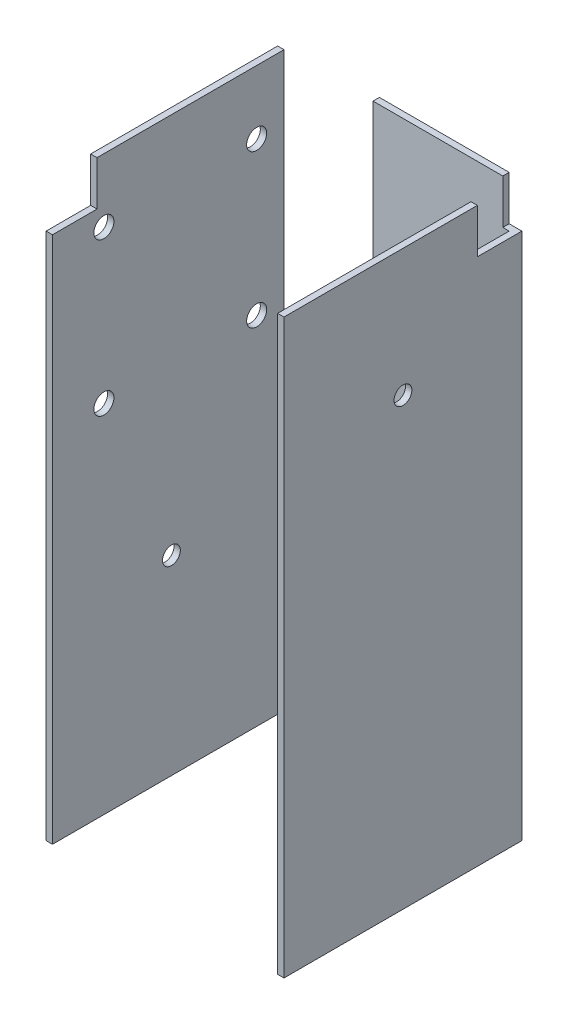
ISO-10303-21;
HEADER;
FILE_DESCRIPTION(('STEP AP214'),'2;1');
FILE_NAME('part.step','',(''),(''),'','','');
FILE_SCHEMA(('AUTOMOTIVE_DESIGN { 1 0 10303 214 1 1 1 1 }'));
ENDSEC;
DATA;
#1=APPLICATION_CONTEXT('core data for automotive mechanical design processes');
#2=APPLICATION_PROTOCOL_DEFINITION('international standard','automotive_design',2000,#1);
#3=PRODUCT_CONTEXT('',#1,'mechanical');
#4=PRODUCT('Part','Part','',(#3));
#5=PRODUCT_RELATED_PRODUCT_CATEGORY('part','',(#4));
#6=PRODUCT_DEFINITION_FORMATION('','',#4);
#7=PRODUCT_DEFINITION_CONTEXT('part definition',#1,'design');
#8=PRODUCT_DEFINITION('design','',#6,#7);
#9=PRODUCT_DEFINITION_SHAPE('','',#8);
#10=(LENGTH_UNIT() NAMED_UNIT(*) SI_UNIT(.MILLI.,.METRE.));
#11=(NAMED_UNIT(*) PLANE_ANGLE_UNIT() SI_UNIT($,.RADIAN.));
#12=(NAMED_UNIT(*) SI_UNIT($,.STERADIAN.) SOLID_ANGLE_UNIT());
#13=UNCERTAINTY_MEASURE_WITH_UNIT(LENGTH_MEASURE(1.E-05),#10,'distance_accuracy_value','');
#14=(GEOMETRIC_REPRESENTATION_CONTEXT(3) GLOBAL_UNCERTAINTY_ASSIGNED_CONTEXT((#13)) GLOBAL_UNIT_ASSIGNED_CONTEXT((#10,
#11,#12)) REPRESENTATION_CONTEXT('',''));
#15=CARTESIAN_POINT('',(0.,0.,0.));
#16=DIRECTION('',(0.,0.,1.));
#17=DIRECTION('',(1.,0.,0.));
#18=AXIS2_PLACEMENT_3D('',#15,#16,#17);
#19=CARTESIAN_POINT('',(0.,114.3,0.));
#20=DIRECTION('',(0.,1.,0.));
#21=DIRECTION('',(0.,0.,1.));
#22=AXIS2_PLACEMENT_3D('',#19,#20,#21);
#23=PLANE('',#22);
#24=DIRECTION('',(1.,0.,0.));
#25=VECTOR('',#24,1.);
#26=CARTESIAN_POINT('',(21.209,114.3,-14.859));
#27=LINE('',#26,#25);
#28=CARTESIAN_POINT('',(22.479,114.3,-14.859));
#29=VERTEX_POINT('',#28);
#30=CARTESIAN_POINT('',(23.749,114.3,-14.859));
#31=VERTEX_POINT('',#30);
#32=EDGE_CURVE('E313',#29,#31,#27,.T.);
#33=ORIENTED_EDGE('',*,*,#32,.F.);
#34=DIRECTION('',(0.,0.,-1.));
#35=VECTOR('',#34,1.);
#36=CARTESIAN_POINT('',(22.479,114.3,0.));
#37=LINE('',#36,#35);
#38=CARTESIAN_POINT('',(22.479,114.3,23.749));
#39=VERTEX_POINT('',#38);
#40=EDGE_CURVE('E240',#39,#29,#37,.T.);
#41=ORIENTED_EDGE('',*,*,#40,.F.);
#42=DIRECTION('',(1.,0.,0.));
#43=VECTOR('',#42,1.);
#44=CARTESIAN_POINT('',(0.,114.3,23.749));
#45=LINE('',#44,#43);
#46=CARTESIAN_POINT('',(23.749,114.3,23.749));
#47=VERTEX_POINT('',#46);
#48=EDGE_CURVE('E201',#39,#47,#45,.T.);
#49=ORIENTED_EDGE('',*,*,#48,.T.);
#50=DIRECTION('',(0.,0.,1.));
#51=VECTOR('',#50,1.);
#52=CARTESIAN_POINT('',(23.749,114.3,0.));
#53=LINE('',#52,#51);
#54=EDGE_CURVE('E194',#31,#47,#53,.T.);
#55=ORIENTED_EDGE('',*,*,#54,.F.);
#56=EDGE_LOOP('',(#33,#41,#49,#55));
#57=FACE_BOUND('',#56,.T.);
#58=ADVANCED_FACE('F44',(#57),#23,.T.);
#59=DIRECTION('',(0.,0.,1.));
#60=VECTOR('',#59,1.);
#61=CARTESIAN_POINT('',(21.209,114.3,-23.749));
#62=LINE('',#61,#60);
#63=CARTESIAN_POINT('',(21.209,114.3,-23.749));
#64=VERTEX_POINT('',#63);
#65=CARTESIAN_POINT('',(21.209,114.3,-22.479));
#66=VERTEX_POINT('',#65);
#67=EDGE_CURVE('E60',#64,#66,#62,.T.);
#68=ORIENTED_EDGE('',*,*,#67,.F.);
#69=DIRECTION('',(1.,0.,0.));
#70=VECTOR('',#69,1.);
#71=CARTESIAN_POINT('',(0.,114.3,-23.749));
#72=LINE('',#71,#70);
#73=CARTESIAN_POINT('',(-4.699,114.3,-23.749));
#74=VERTEX_POINT('',#73);
#75=EDGE_CURVE('E182',#74,#64,#72,.T.);
#76=ORIENTED_EDGE('',*,*,#75,.F.);
#77=DIRECTION('',(0.,0.,-1.));
#78=VECTOR('',#77,1.);
#79=CARTESIAN_POINT('',(-4.699,114.3,-23.749));
#80=LINE('',#79,#78);
#81=CARTESIAN_POINT('',(-4.699,114.3,-22.479));
#82=VERTEX_POINT('',#81);
#83=EDGE_CURVE('E357',#82,#74,#80,.T.);
#84=ORIENTED_EDGE('',*,*,#83,.F.);
#85=DIRECTION('',(1.,0.,0.));
#86=VECTOR('',#85,1.);
#87=CARTESIAN_POINT('',(0.,114.3,-22.479));
#88=LINE('',#87,#86);
#89=EDGE_CURVE('E184',#82,#66,#88,.T.);
#90=ORIENTED_EDGE('',*,*,#89,.T.);
#91=EDGE_LOOP('',(#68,#76,#84,#90));
#92=FACE_BOUND('',#91,.T.);
#93=ADVANCED_FACE('F180',(#92),#23,.T.);
#94=CARTESIAN_POINT('',(22.479,114.3,0.));
#95=DIRECTION('',(-1.,0.,0.));
#96=DIRECTION('',(0.,0.,1.));
#97=AXIS2_PLACEMENT_3D('',#94,#95,#96);
#98=PLANE('',#97);
#99=DIRECTION('',(0.,0.,1.));
#100=VECTOR('',#99,1.);
#101=CARTESIAN_POINT('',(22.479,105.41,0.));
#102=LINE('',#101,#100);
#103=CARTESIAN_POINT('',(22.479,105.41,-22.479));
#104=VERTEX_POINT('',#103);
#105=CARTESIAN_POINT('',(22.479,105.41,-14.859));
#106=VERTEX_POINT('',#105);
#107=EDGE_CURVE('E327',#104,#106,#102,.T.);
#108=ORIENTED_EDGE('',*,*,#107,.F.);
#109=DIRECTION('',(0.,-1.,0.));
#110=VECTOR('',#109,1.);
#111=CARTESIAN_POINT('',(22.479,114.3,-22.479));
#112=LINE('',#111,#110);
#113=CARTESIAN_POINT('',(22.479,0.,-22.479));
#114=VERTEX_POINT('',#113);
#115=EDGE_CURVE('E209',#104,#114,#112,.T.);
#116=ORIENTED_EDGE('',*,*,#115,.T.);
#117=DIRECTION('',(0.,0.,-1.));
#118=VECTOR('',#117,1.);
#119=CARTESIAN_POINT('',(22.479,0.,0.));
#120=LINE('',#119,#118);
#121=CARTESIAN_POINT('',(22.479,0.,23.749));
#122=VERTEX_POINT('',#121);
#123=EDGE_CURVE('E210',#122,#114,#120,.T.);
#124=ORIENTED_EDGE('',*,*,#123,.F.);
#125=DIRECTION('',(0.,-1.,0.));
#126=VECTOR('',#125,1.);
#127=CARTESIAN_POINT('',(22.479,114.3,23.749));
#128=LINE('',#127,#126);
#129=EDGE_CURVE('E262',#39,#122,#128,.T.);
#130=ORIENTED_EDGE('',*,*,#129,.F.);
#131=ORIENTED_EDGE('',*,*,#40,.T.);
#132=DIRECTION('',(0.,1.,0.));
#133=VECTOR('',#132,1.);
#134=CARTESIAN_POINT('',(22.479,114.3,-14.859));
#135=LINE('',#134,#133);
#136=EDGE_CURVE('E332',#106,#29,#135,.T.);
#137=ORIENTED_EDGE('',*,*,#136,.F.);
#138=EDGE_LOOP('',(#108,#116,#124,#130,#131,#137));
#139=FACE_BOUND('',#138,.T.);
#140=CARTESIAN_POINT('',(22.479,88.9,0.));
#141=DIRECTION('',(-1.,0.,0.));
#142=DIRECTION('',(0.,0.,1.));
#143=AXIS2_PLACEMENT_3D('',#140,#141,#142);
#144=CIRCLE('',#143,1.778);
#145=CARTESIAN_POINT('',(22.479,88.9,1.778));
#146=VERTEX_POINT('',#145);
#147=EDGE_CURVE('E403',#146,#146,#144,.T.);
#148=ORIENTED_EDGE('',*,*,#147,.F.);
#149=EDGE_LOOP('',(#148));
#150=FACE_BOUND('',#149,.T.);
#151=ADVANCED_FACE('F46',(#139,#150),#98,.T.);
#152=CARTESIAN_POINT('',(0.,114.3,23.749));
#153=DIRECTION('',(0.,0.,-1.));
#154=DIRECTION('',(-1.,0.,0.));
#155=AXIS2_PLACEMENT_3D('',#152,#153,#154);
#156=PLANE('',#155);
#157=DIRECTION('',(1.,0.,0.));
#158=VECTOR('',#157,1.);
#159=CARTESIAN_POINT('',(0.,0.,23.749));
#160=LINE('',#159,#158);
#161=CARTESIAN_POINT('',(23.749,0.,23.749));
#162=VERTEX_POINT('',#161);
#163=EDGE_CURVE('E214',#122,#162,#160,.T.);
#164=ORIENTED_EDGE('',*,*,#163,.T.);
#165=DIRECTION('',(0.,-1.,0.));
#166=VECTOR('',#165,1.);
#167=CARTESIAN_POINT('',(23.749,114.3,23.749));
#168=LINE('',#167,#166);
#169=EDGE_CURVE('E259',#47,#162,#168,.T.);
#170=ORIENTED_EDGE('',*,*,#169,.F.);
#171=ORIENTED_EDGE('',*,*,#48,.F.);
#172=ORIENTED_EDGE('',*,*,#129,.T.);
#173=EDGE_LOOP('',(#164,#170,#171,#172));
#174=FACE_BOUND('',#173,.T.);
#175=ADVANCED_FACE('F424',(#174),#156,.F.);
#176=CARTESIAN_POINT('',(23.749,114.3,0.));
#177=DIRECTION('',(1.,0.,0.));
#178=DIRECTION('',(0.,0.,-1.));
#179=AXIS2_PLACEMENT_3D('',#176,#177,#178);
#180=PLANE('',#179);
#181=DIRECTION('',(0.,0.,-1.));
#182=VECTOR('',#181,1.);
#183=CARTESIAN_POINT('',(23.749,105.41,-23.749));
#184=LINE('',#183,#182);
#185=CARTESIAN_POINT('',(23.749,105.41,-14.859));
#186=VERTEX_POINT('',#185);
#187=CARTESIAN_POINT('',(23.749,105.41,-23.749));
#188=VERTEX_POINT('',#187);
#189=EDGE_CURVE('E175',#186,#188,#184,.T.);
#190=ORIENTED_EDGE('',*,*,#189,.F.);
#191=DIRECTION('',(0.,-1.,0.));
#192=VECTOR('',#191,1.);
#193=CARTESIAN_POINT('',(23.749,114.3,-14.859));
#194=LINE('',#193,#192);
#195=EDGE_CURVE('E319',#31,#186,#194,.T.);
#196=ORIENTED_EDGE('',*,*,#195,.F.);
#197=ORIENTED_EDGE('',*,*,#54,.T.);
#198=ORIENTED_EDGE('',*,*,#169,.T.);
#199=DIRECTION('',(0.,0.,1.));
#200=VECTOR('',#199,1.);
#201=CARTESIAN_POINT('',(23.749,0.,0.));
#202=LINE('',#201,#200);
#203=CARTESIAN_POINT('',(23.749,0.,-23.749));
#204=VERTEX_POINT('',#203);
#205=EDGE_CURVE('E219',#204,#162,#202,.T.);
#206=ORIENTED_EDGE('',*,*,#205,.F.);
#207=DIRECTION('',(0.,-1.,0.));
#208=VECTOR('',#207,1.);
#209=CARTESIAN_POINT('',(23.749,114.3,-23.749));
#210=LINE('',#209,#208);
#211=EDGE_CURVE('E256',#188,#204,#210,.T.);
#212=ORIENTED_EDGE('',*,*,#211,.F.);
#213=EDGE_LOOP('',(#190,#196,#197,#198,#206,#212));
#214=FACE_BOUND('',#213,.T.);
#215=CARTESIAN_POINT('',(23.749,88.9,0.));
#216=DIRECTION('',(1.,0.,0.));
#217=DIRECTION('',(0.,0.,-1.));
#218=AXIS2_PLACEMENT_3D('',#215,#216,#217);
#219=CIRCLE('',#218,1.778);
#220=CARTESIAN_POINT('',(23.749,88.9,-1.77799999999999));
#221=VERTEX_POINT('',#220);
#222=EDGE_CURVE('E279',#221,#221,#219,.T.);
#223=ORIENTED_EDGE('',*,*,#222,.F.);
#224=EDGE_LOOP('',(#223));
#225=FACE_BOUND('',#224,.T.);
#226=ADVANCED_FACE('F429',(#214,#225),#180,.T.);
#227=CARTESIAN_POINT('',(0.,114.3,-23.749));
#228=DIRECTION('',(0.,0.,-1.));
#229=DIRECTION('',(-1.,0.,0.));
#230=AXIS2_PLACEMENT_3D('',#227,#228,#229);
#231=PLANE('',#230);
#232=DIRECTION('',(1.,0.,0.));
#233=VECTOR('',#232,1.);
#234=CARTESIAN_POINT('',(21.209,105.41,-23.749));
#235=LINE('',#234,#233);
#236=CARTESIAN_POINT('',(21.209,105.41,-23.749));
#237=VERTEX_POINT('',#236);
#238=EDGE_CURVE('E311',#237,#188,#235,.T.);
#239=ORIENTED_EDGE('',*,*,#238,.T.);
#240=ORIENTED_EDGE('',*,*,#211,.T.);
#241=DIRECTION('',(1.,0.,0.));
#242=VECTOR('',#241,1.);
#243=CARTESIAN_POINT('',(0.,0.,-23.749));
#244=LINE('',#243,#242);
#245=CARTESIAN_POINT('',(-23.749,0.,-23.749));
#246=VERTEX_POINT('',#245);
#247=EDGE_CURVE('E224',#246,#204,#244,.T.);
#248=ORIENTED_EDGE('',*,*,#247,.F.);
#249=DIRECTION('',(0.,-1.,0.));
#250=VECTOR('',#249,1.);
#251=CARTESIAN_POINT('',(-23.749,114.3,-23.749));
#252=LINE('',#251,#250);
#253=CARTESIAN_POINT('',(-23.749,66.675,-23.749));
#254=VERTEX_POINT('',#253);
#255=EDGE_CURVE('E253',#254,#246,#252,.T.);
#256=ORIENTED_EDGE('',*,*,#255,.F.);
#257=DIRECTION('',(-1.,0.,0.));
#258=VECTOR('',#257,1.);
#259=CARTESIAN_POINT('',(-23.749,66.675,-23.749));
#260=LINE('',#259,#258);
#261=CARTESIAN_POINT('',(-4.699,66.675,-23.749));
#262=VERTEX_POINT('',#261);
#263=EDGE_CURVE('E366',#262,#254,#260,.T.);
#264=ORIENTED_EDGE('',*,*,#263,.F.);
#265=DIRECTION('',(0.,1.,0.));
#266=VECTOR('',#265,1.);
#267=CARTESIAN_POINT('',(-4.699,66.675,-23.749));
#268=LINE('',#267,#266);
#269=EDGE_CURVE('E191',#262,#74,#268,.T.);
#270=ORIENTED_EDGE('',*,*,#269,.T.);
#271=ORIENTED_EDGE('',*,*,#75,.T.);
#272=DIRECTION('',(0.,1.,0.));
#273=VECTOR('',#272,1.);
#274=CARTESIAN_POINT('',(21.209,114.3,-23.749));
#275=LINE('',#274,#273);
#276=EDGE_CURVE('E166',#237,#64,#275,.T.);
#277=ORIENTED_EDGE('',*,*,#276,.F.);
#278=EDGE_LOOP('',(#239,#240,#248,#256,#264,#270,#271,#277));
#279=FACE_BOUND('',#278,.T.);
#280=CARTESIAN_POINT('',(0.,25.4,-23.749));
#281=DIRECTION('',(0.,0.,-1.));
#282=DIRECTION('',(-1.,0.,0.));
#283=AXIS2_PLACEMENT_3D('',#280,#281,#282);
#284=CIRCLE('',#283,1.778);
#285=CARTESIAN_POINT('',(-1.778,25.4,-23.749));
#286=VERTEX_POINT('',#285);
#287=EDGE_CURVE('E280',#286,#286,#284,.T.);
#288=ORIENTED_EDGE('',*,*,#287,.F.);
#289=EDGE_LOOP('',(#288));
#290=FACE_BOUND('',#289,.T.);
#291=CARTESIAN_POINT('',(0.,57.15,-23.749));
#292=DIRECTION('',(0.,0.,-1.));
#293=DIRECTION('',(-1.,0.,0.));
#294=AXIS2_PLACEMENT_3D('',#291,#292,#293);
#295=CIRCLE('',#294,1.778);
#296=CARTESIAN_POINT('',(-1.778,57.15,-23.749));
#297=VERTEX_POINT('',#296);
#298=EDGE_CURVE('E269',#297,#297,#295,.T.);
#299=ORIENTED_EDGE('',*,*,#298,.F.);
#300=EDGE_LOOP('',(#299));
#301=FACE_BOUND('',#300,.T.);
#302=ADVANCED_FACE('F188',(#279,#290,#301),#231,.T.);
#303=CARTESIAN_POINT('',(-23.749,114.3,0.));
#304=DIRECTION('',(1.,0.,0.));
#305=DIRECTION('',(0.,0.,-1.));
#306=AXIS2_PLACEMENT_3D('',#303,#304,#305);
#307=PLANE('',#306);
#308=CARTESIAN_POINT('',(-23.749,71.1,-17.018));
#309=DIRECTION('',(-1.,0.,0.));
#310=DIRECTION('',(0.,0.,1.));
#311=AXIS2_PLACEMENT_3D('',#308,#309,#310);
#312=CIRCLE('',#311,2.);
#313=CARTESIAN_POINT('',(-23.749,71.1,-15.018));
#314=VERTEX_POINT('',#313);
#315=EDGE_CURVE('E377',#314,#314,#312,.T.);
#316=ORIENTED_EDGE('',*,*,#315,.F.);
#317=EDGE_LOOP('',(#316));
#318=FACE_BOUND('',#317,.T.);
#319=CARTESIAN_POINT('',(-23.749,71.1,13.482));
#320=DIRECTION('',(-1.,0.,0.));
#321=DIRECTION('',(0.,0.,1.));
#322=AXIS2_PLACEMENT_3D('',#319,#320,#321);
#323=CIRCLE('',#322,2.00000000000001);
#324=CARTESIAN_POINT('',(-23.749,71.1,15.482));
#325=VERTEX_POINT('',#324);
#326=EDGE_CURVE('E387',#325,#325,#323,.T.);
#327=ORIENTED_EDGE('',*,*,#326,.F.);
#328=EDGE_LOOP('',(#327));
#329=FACE_BOUND('',#328,.T.);
#330=CARTESIAN_POINT('',(-23.749,101.6,13.482));
#331=DIRECTION('',(-1.,0.,0.));
#332=DIRECTION('',(0.,0.,1.));
#333=AXIS2_PLACEMENT_3D('',#330,#331,#332);
#334=CIRCLE('',#333,2.00000000000001);
#335=CARTESIAN_POINT('',(-23.749,101.6,15.482));
#336=VERTEX_POINT('',#335);
#337=EDGE_CURVE('E383',#336,#336,#334,.T.);
#338=ORIENTED_EDGE('',*,*,#337,.F.);
#339=EDGE_LOOP('',(#338));
#340=FACE_BOUND('',#339,.T.);
#341=CARTESIAN_POINT('',(-23.749,101.6,-17.018));
#342=DIRECTION('',(-1.,0.,0.));
#343=DIRECTION('',(0.,0.,1.));
#344=AXIS2_PLACEMENT_3D('',#341,#342,#343);
#345=CIRCLE('',#344,2.00000000000001);
#346=CARTESIAN_POINT('',(-23.749,101.6,-15.018));
#347=VERTEX_POINT('',#346);
#348=EDGE_CURVE('E286',#347,#347,#345,.T.);
#349=ORIENTED_EDGE('',*,*,#348,.F.);
#350=EDGE_LOOP('',(#349));
#351=FACE_BOUND('',#350,.T.);
#352=CARTESIAN_POINT('',(-23.749,38.1,0.));
#353=DIRECTION('',(-1.,0.,0.));
#354=DIRECTION('',(0.,0.,1.));
#355=AXIS2_PLACEMENT_3D('',#352,#353,#354);
#356=CIRCLE('',#355,1.778);
#357=CARTESIAN_POINT('',(-23.749,38.1,1.778));
#358=VERTEX_POINT('',#357);
#359=EDGE_CURVE('E274',#358,#358,#356,.T.);
#360=ORIENTED_EDGE('',*,*,#359,.F.);
#361=EDGE_LOOP('',(#360));
#362=FACE_BOUND('',#361,.T.);
#363=DIRECTION('',(0.,-1.,0.));
#364=VECTOR('',#363,1.);
#365=CARTESIAN_POINT('',(-23.749,114.3,23.749));
#366=LINE('',#365,#364);
#367=CARTESIAN_POINT('',(-23.749,105.41,23.749));
#368=VERTEX_POINT('',#367);
#369=CARTESIAN_POINT('',(-23.749,0.,23.749));
#370=VERTEX_POINT('',#369);
#371=EDGE_CURVE('E250',#368,#370,#366,.T.);
#372=ORIENTED_EDGE('',*,*,#371,.F.);
#373=DIRECTION('',(0.,0.,1.));
#374=VECTOR('',#373,1.);
#375=CARTESIAN_POINT('',(-23.749,105.41,23.749));
#376=LINE('',#375,#374);
#377=CARTESIAN_POINT('',(-23.749,105.41,14.859));
#378=VERTEX_POINT('',#377);
#379=EDGE_CURVE('E339',#378,#368,#376,.T.);
#380=ORIENTED_EDGE('',*,*,#379,.F.);
#381=DIRECTION('',(0.,-1.,0.));
#382=VECTOR('',#381,1.);
#383=CARTESIAN_POINT('',(-23.749,114.3,14.859));
#384=LINE('',#383,#382);
#385=CARTESIAN_POINT('',(-23.749,114.3,14.859));
#386=VERTEX_POINT('',#385);
#387=EDGE_CURVE('E335',#386,#378,#384,.T.);
#388=ORIENTED_EDGE('',*,*,#387,.F.);
#389=DIRECTION('',(0.,0.,1.));
#390=VECTOR('',#389,1.);
#391=CARTESIAN_POINT('',(-23.749,114.3,0.));
#392=LINE('',#391,#390);
#393=CARTESIAN_POINT('',(-23.749,114.3,-22.479));
#394=VERTEX_POINT('',#393);
#395=EDGE_CURVE('E193',#394,#386,#392,.T.);
#396=ORIENTED_EDGE('',*,*,#395,.F.);
#397=DIRECTION('',(0.,1.,0.));
#398=VECTOR('',#397,1.);
#399=CARTESIAN_POINT('',(-23.749,66.675,-22.479));
#400=LINE('',#399,#398);
#401=CARTESIAN_POINT('',(-23.749,66.675,-22.479));
#402=VERTEX_POINT('',#401);
#403=EDGE_CURVE('E369',#402,#394,#400,.T.);
#404=ORIENTED_EDGE('',*,*,#403,.F.);
#405=DIRECTION('',(0.,0.,1.));
#406=VECTOR('',#405,1.);
#407=CARTESIAN_POINT('',(-23.749,66.675,-23.749));
#408=LINE('',#407,#406);
#409=EDGE_CURVE('E352',#254,#402,#408,.T.);
#410=ORIENTED_EDGE('',*,*,#409,.F.);
#411=ORIENTED_EDGE('',*,*,#255,.T.);
#412=DIRECTION('',(0.,0.,1.));
#413=VECTOR('',#412,1.);
#414=CARTESIAN_POINT('',(-23.749,0.,0.));
#415=LINE('',#414,#413);
#416=EDGE_CURVE('E228',#246,#370,#415,.T.);
#417=ORIENTED_EDGE('',*,*,#416,.T.);
#418=EDGE_LOOP('',(#372,#380,#388,#396,#404,#410,#411,#417));
#419=FACE_BOUND('',#418,.T.);
#420=ADVANCED_FACE('F450',(#318,#329,#340,#351,#362,#419),#307,.F.);
#421=DIRECTION('',(0.,-1.,0.));
#422=VECTOR('',#421,1.);
#423=CARTESIAN_POINT('',(-22.479,114.3,23.749));
#424=LINE('',#423,#422);
#425=CARTESIAN_POINT('',(-22.479,105.41,23.749));
#426=VERTEX_POINT('',#425);
#427=CARTESIAN_POINT('',(-22.479,0.,23.749));
#428=VERTEX_POINT('',#427);
#429=EDGE_CURVE('E247',#426,#428,#424,.T.);
#430=ORIENTED_EDGE('',*,*,#429,.F.);
#431=DIRECTION('',(-1.,0.,0.));
#432=VECTOR('',#431,1.);
#433=CARTESIAN_POINT('',(14.351,105.41,23.749));
#434=LINE('',#433,#432);
#435=EDGE_CURVE('E343',#426,#368,#434,.T.);
#436=ORIENTED_EDGE('',*,*,#435,.T.);
#437=ORIENTED_EDGE('',*,*,#371,.T.);
#438=EDGE_CURVE('E220',#370,#428,#160,.T.);
#439=ORIENTED_EDGE('',*,*,#438,.T.);
#440=EDGE_LOOP('',(#430,#436,#437,#439));
#441=FACE_BOUND('',#440,.T.);
#442=ADVANCED_FACE('F471',(#441),#156,.F.);
#443=CARTESIAN_POINT('',(-22.479,114.3,0.));
#444=DIRECTION('',(-1.,0.,0.));
#445=DIRECTION('',(0.,0.,1.));
#446=AXIS2_PLACEMENT_3D('',#443,#444,#445);
#447=PLANE('',#446);
#448=CARTESIAN_POINT('',(-22.479,71.1,-17.018));
#449=DIRECTION('',(-1.,0.,0.));
#450=DIRECTION('',(0.,0.,1.));
#451=AXIS2_PLACEMENT_3D('',#448,#449,#450);
#452=CIRCLE('',#451,2.);
#453=CARTESIAN_POINT('',(-22.479,71.1,-15.018));
#454=VERTEX_POINT('',#453);
#455=EDGE_CURVE('E294',#454,#454,#452,.T.);
#456=ORIENTED_EDGE('',*,*,#455,.T.);
#457=EDGE_LOOP('',(#456));
#458=FACE_BOUND('',#457,.T.);
#459=CARTESIAN_POINT('',(-22.479,71.1,13.482));
#460=DIRECTION('',(-1.,0.,0.));
#461=DIRECTION('',(0.,0.,1.));
#462=AXIS2_PLACEMENT_3D('',#459,#460,#461);
#463=CIRCLE('',#462,2.00000000000001);
#464=CARTESIAN_POINT('',(-22.479,71.1,15.482));
#465=VERTEX_POINT('',#464);
#466=EDGE_CURVE('E290',#465,#465,#463,.T.);
#467=ORIENTED_EDGE('',*,*,#466,.T.);
#468=EDGE_LOOP('',(#467));
#469=FACE_BOUND('',#468,.T.);
#470=CARTESIAN_POINT('',(-22.479,101.6,13.482));
#471=DIRECTION('',(-1.,0.,0.));
#472=DIRECTION('',(0.,0.,1.));
#473=AXIS2_PLACEMENT_3D('',#470,#471,#472);
#474=CIRCLE('',#473,2.00000000000001);
#475=CARTESIAN_POINT('',(-22.479,101.6,15.482));
#476=VERTEX_POINT('',#475);
#477=EDGE_CURVE('E285',#476,#476,#474,.T.);
#478=ORIENTED_EDGE('',*,*,#477,.T.);
#479=EDGE_LOOP('',(#478));
#480=FACE_BOUND('',#479,.T.);
#481=CARTESIAN_POINT('',(-22.479,101.6,-17.018));
#482=DIRECTION('',(-1.,0.,0.));
#483=DIRECTION('',(0.,0.,1.));
#484=AXIS2_PLACEMENT_3D('',#481,#482,#483);
#485=CIRCLE('',#484,2.00000000000001);
#486=CARTESIAN_POINT('',(-22.479,101.6,-15.018));
#487=VERTEX_POINT('',#486);
#488=EDGE_CURVE('E281',#487,#487,#485,.T.);
#489=ORIENTED_EDGE('',*,*,#488,.T.);
#490=EDGE_LOOP('',(#489));
#491=FACE_BOUND('',#490,.T.);
#492=CARTESIAN_POINT('',(-22.479,38.1,0.));
#493=DIRECTION('',(-1.,0.,0.));
#494=DIRECTION('',(0.,0.,1.));
#495=AXIS2_PLACEMENT_3D('',#492,#493,#494);
#496=CIRCLE('',#495,1.778);
#497=CARTESIAN_POINT('',(-22.479,38.1,1.778));
#498=VERTEX_POINT('',#497);
#499=EDGE_CURVE('E270',#498,#498,#496,.T.);
#500=ORIENTED_EDGE('',*,*,#499,.T.);
#501=EDGE_LOOP('',(#500));
#502=FACE_BOUND('',#501,.T.);
#503=DIRECTION('',(0.,-1.,0.));
#504=VECTOR('',#503,1.);
#505=CARTESIAN_POINT('',(-22.479,114.3,14.859));
#506=LINE('',#505,#504);
#507=CARTESIAN_POINT('',(-22.479,114.3,14.859));
#508=VERTEX_POINT('',#507);
#509=CARTESIAN_POINT('',(-22.479,105.41,14.859));
#510=VERTEX_POINT('',#509);
#511=EDGE_CURVE('E68',#508,#510,#506,.T.);
#512=ORIENTED_EDGE('',*,*,#511,.T.);
#513=DIRECTION('',(0.,0.,1.));
#514=VECTOR('',#513,1.);
#515=CARTESIAN_POINT('',(-22.479,105.41,0.));
#516=LINE('',#515,#514);
#517=EDGE_CURVE('E300',#510,#426,#516,.T.);
#518=ORIENTED_EDGE('',*,*,#517,.T.);
#519=ORIENTED_EDGE('',*,*,#429,.T.);
#520=DIRECTION('',(0.,0.,-1.));
#521=VECTOR('',#520,1.);
#522=CARTESIAN_POINT('',(-22.479,0.,0.));
#523=LINE('',#522,#521);
#524=CARTESIAN_POINT('',(-22.479,0.,-22.479));
#525=VERTEX_POINT('',#524);
#526=EDGE_CURVE('E232',#428,#525,#523,.T.);
#527=ORIENTED_EDGE('',*,*,#526,.T.);
#528=DIRECTION('',(0.,-1.,0.));
#529=VECTOR('',#528,1.);
#530=CARTESIAN_POINT('',(-22.479,114.3,-22.479));
#531=LINE('',#530,#529);
#532=CARTESIAN_POINT('',(-22.479,66.675,-22.479));
#533=VERTEX_POINT('',#532);
#534=EDGE_CURVE('E243',#533,#525,#531,.T.);
#535=ORIENTED_EDGE('',*,*,#534,.F.);
#536=CARTESIAN_POINT('',(-22.479,114.3,-22.479));
#537=VERTEX_POINT('',#536);
#538=EDGE_CURVE('E244',#537,#533,#531,.T.);
#539=ORIENTED_EDGE('',*,*,#538,.F.);
#540=DIRECTION('',(0.,0.,-1.));
#541=VECTOR('',#540,1.);
#542=CARTESIAN_POINT('',(-22.479,114.3,0.));
#543=LINE('',#542,#541);
#544=EDGE_CURVE('E199',#508,#537,#543,.T.);
#545=ORIENTED_EDGE('',*,*,#544,.F.);
#546=EDGE_LOOP('',(#512,#518,#519,#527,#535,#539,#545));
#547=FACE_BOUND('',#546,.T.);
#548=ADVANCED_FACE('F463',(#458,#469,#480,#491,#502,#547),#447,.F.);
#549=CARTESIAN_POINT('',(0.,114.3,-22.479));
#550=DIRECTION('',(0.,0.,-1.));
#551=DIRECTION('',(-1.,0.,0.));
#552=AXIS2_PLACEMENT_3D('',#549,#550,#551);
#553=PLANE('',#552);
#554=CARTESIAN_POINT('',(0.,25.4,-22.479));
#555=DIRECTION('',(0.,0.,-1.));
#556=DIRECTION('',(-1.,0.,0.));
#557=AXIS2_PLACEMENT_3D('',#554,#555,#556);
#558=CIRCLE('',#557,1.778);
#559=CARTESIAN_POINT('',(-1.778,25.4,-22.479));
#560=VERTEX_POINT('',#559);
#561=EDGE_CURVE('E275',#560,#560,#558,.T.);
#562=ORIENTED_EDGE('',*,*,#561,.T.);
#563=EDGE_LOOP('',(#562));
#564=FACE_BOUND('',#563,.T.);
#565=CARTESIAN_POINT('',(0.,57.15,-22.479));
#566=DIRECTION('',(0.,0.,-1.));
#567=DIRECTION('',(-1.,0.,0.));
#568=AXIS2_PLACEMENT_3D('',#565,#566,#567);
#569=CIRCLE('',#568,1.778);
#570=CARTESIAN_POINT('',(-1.778,57.15,-22.479));
#571=VERTEX_POINT('',#570);
#572=EDGE_CURVE('E215',#571,#571,#569,.T.);
#573=ORIENTED_EDGE('',*,*,#572,.T.);
#574=EDGE_LOOP('',(#573));
#575=FACE_BOUND('',#574,.T.);
#576=ORIENTED_EDGE('',*,*,#115,.F.);
#577=DIRECTION('',(-1.,0.,0.));
#578=VECTOR('',#577,1.);
#579=CARTESIAN_POINT('',(0.,105.41,-22.479));
#580=LINE('',#579,#578);
#581=CARTESIAN_POINT('',(21.209,105.41,-22.479));
#582=VERTEX_POINT('',#581);
#583=EDGE_CURVE('E11',#104,#582,#580,.T.);
#584=ORIENTED_EDGE('',*,*,#583,.T.);
#585=DIRECTION('',(0.,1.,0.));
#586=VECTOR('',#585,1.);
#587=CARTESIAN_POINT('',(21.209,114.3,-22.479));
#588=LINE('',#587,#586);
#589=EDGE_CURVE('E53',#582,#66,#588,.T.);
#590=ORIENTED_EDGE('',*,*,#589,.T.);
#591=ORIENTED_EDGE('',*,*,#89,.F.);
#592=DIRECTION('',(0.,1.,0.));
#593=VECTOR('',#592,1.);
#594=CARTESIAN_POINT('',(-4.699,66.675,-22.479));
#595=LINE('',#594,#593);
#596=CARTESIAN_POINT('',(-4.699,66.675,-22.479));
#597=VERTEX_POINT('',#596);
#598=EDGE_CURVE('E378',#597,#82,#595,.T.);
#599=ORIENTED_EDGE('',*,*,#598,.F.);
#600=DIRECTION('',(1.,0.,0.));
#601=VECTOR('',#600,1.);
#602=CARTESIAN_POINT('',(-23.749,66.675,-22.479));
#603=LINE('',#602,#601);
#604=EDGE_CURVE('E356',#533,#597,#603,.T.);
#605=ORIENTED_EDGE('',*,*,#604,.F.);
#606=ORIENTED_EDGE('',*,*,#534,.T.);
#607=DIRECTION('',(1.,0.,0.));
#608=VECTOR('',#607,1.);
#609=CARTESIAN_POINT('',(0.,0.,-22.479));
#610=LINE('',#609,#608);
#611=EDGE_CURVE('E236',#525,#114,#610,.T.);
#612=ORIENTED_EDGE('',*,*,#611,.T.);
#613=EDGE_LOOP('',(#576,#584,#590,#591,#599,#605,#606,#612));
#614=FACE_BOUND('',#613,.T.);
#615=ADVANCED_FACE('F306',(#564,#575,#614),#553,.F.);
#616=DIRECTION('',(-1.,0.,0.));
#617=VECTOR('',#616,1.);
#618=CARTESIAN_POINT('',(0.,114.3,14.859));
#619=LINE('',#618,#617);
#620=EDGE_CURVE('E265',#508,#386,#619,.T.);
#621=ORIENTED_EDGE('',*,*,#620,.F.);
#622=ORIENTED_EDGE('',*,*,#544,.T.);
#623=DIRECTION('',(1.,0.,0.));
#624=VECTOR('',#623,1.);
#625=CARTESIAN_POINT('',(-23.749,114.3,-22.479));
#626=LINE('',#625,#624);
#627=EDGE_CURVE('E351',#394,#537,#626,.T.);
#628=ORIENTED_EDGE('',*,*,#627,.F.);
#629=ORIENTED_EDGE('',*,*,#395,.T.);
#630=EDGE_LOOP('',(#621,#622,#628,#629));
#631=FACE_BOUND('',#630,.T.);
#632=ADVANCED_FACE('F478',(#631),#23,.T.);
#633=CARTESIAN_POINT('',(0.,0.,0.));
#634=DIRECTION('',(0.,1.,0.));
#635=DIRECTION('',(0.,0.,1.));
#636=AXIS2_PLACEMENT_3D('',#633,#634,#635);
#637=PLANE('',#636);
#638=ORIENTED_EDGE('',*,*,#123,.T.);
#639=ORIENTED_EDGE('',*,*,#611,.F.);
#640=ORIENTED_EDGE('',*,*,#526,.F.);
#641=ORIENTED_EDGE('',*,*,#438,.F.);
#642=ORIENTED_EDGE('',*,*,#416,.F.);
#643=ORIENTED_EDGE('',*,*,#247,.T.);
#644=ORIENTED_EDGE('',*,*,#205,.T.);
#645=ORIENTED_EDGE('',*,*,#163,.F.);
#646=EDGE_LOOP('',(#638,#639,#640,#641,#642,#643,#644,#645));
#647=FACE_BOUND('',#646,.T.);
#648=ADVANCED_FACE('F441',(#647),#637,.F.);
#649=CARTESIAN_POINT('',(0.,57.15,-18.669));
#650=DIRECTION('',(0.,0.,-1.));
#651=DIRECTION('',(-1.,0.,0.));
#652=AXIS2_PLACEMENT_3D('',#649,#650,#651);
#653=CYLINDRICAL_SURFACE('',#652,1.778);
#654=ORIENTED_EDGE('',*,*,#298,.T.);
#655=EDGE_LOOP('',(#654));
#656=FACE_BOUND('',#655,.T.);
#657=ORIENTED_EDGE('',*,*,#572,.F.);
#658=EDGE_LOOP('',(#657));
#659=FACE_BOUND('',#658,.T.);
#660=ADVANCED_FACE('F508',(#656,#659),#653,.F.);
#661=CARTESIAN_POINT('',(-18.669,38.1,0.));
#662=DIRECTION('',(-1.,0.,0.));
#663=DIRECTION('',(0.,0.,1.));
#664=AXIS2_PLACEMENT_3D('',#661,#662,#663);
#665=CYLINDRICAL_SURFACE('',#664,1.778);
#666=ORIENTED_EDGE('',*,*,#359,.T.);
#667=EDGE_LOOP('',(#666));
#668=FACE_BOUND('',#667,.T.);
#669=ORIENTED_EDGE('',*,*,#499,.F.);
#670=EDGE_LOOP('',(#669));
#671=FACE_BOUND('',#670,.T.);
#672=ADVANCED_FACE('F677',(#668,#671),#665,.F.);
#673=CARTESIAN_POINT('',(18.669,88.9,0.));
#674=DIRECTION('',(1.,0.,0.));
#675=DIRECTION('',(0.,0.,-1.));
#676=AXIS2_PLACEMENT_3D('',#673,#674,#675);
#677=CYLINDRICAL_SURFACE('',#676,1.778);
#678=ORIENTED_EDGE('',*,*,#147,.T.);
#679=EDGE_LOOP('',(#678));
#680=FACE_BOUND('',#679,.T.);
#681=ORIENTED_EDGE('',*,*,#222,.T.);
#682=EDGE_LOOP('',(#681));
#683=FACE_BOUND('',#682,.T.);
#684=ADVANCED_FACE('F666',(#680,#683),#677,.F.);
#685=CARTESIAN_POINT('',(0.,25.4,-18.669));
#686=DIRECTION('',(0.,0.,-1.));
#687=DIRECTION('',(-1.,0.,0.));
#688=AXIS2_PLACEMENT_3D('',#685,#686,#687);
#689=CYLINDRICAL_SURFACE('',#688,1.778);
#690=ORIENTED_EDGE('',*,*,#287,.T.);
#691=EDGE_LOOP('',(#690));
#692=FACE_BOUND('',#691,.T.);
#693=ORIENTED_EDGE('',*,*,#561,.F.);
#694=EDGE_LOOP('',(#693));
#695=FACE_BOUND('',#694,.T.);
#696=ADVANCED_FACE('F655',(#692,#695),#689,.F.);
#697=CARTESIAN_POINT('',(-21.209,101.6,-17.018));
#698=DIRECTION('',(-1.,0.,0.));
#699=DIRECTION('',(0.,0.,1.));
#700=AXIS2_PLACEMENT_3D('',#697,#698,#699);
#701=CYLINDRICAL_SURFACE('',#700,2.00000000000001);
#702=ORIENTED_EDGE('',*,*,#348,.T.);
#703=EDGE_LOOP('',(#702));
#704=FACE_BOUND('',#703,.T.);
#705=ORIENTED_EDGE('',*,*,#488,.F.);
#706=EDGE_LOOP('',(#705));
#707=FACE_BOUND('',#706,.T.);
#708=ADVANCED_FACE('F645',(#704,#707),#701,.F.);
#709=CARTESIAN_POINT('',(-21.209,101.6,13.482));
#710=DIRECTION('',(-1.,0.,0.));
#711=DIRECTION('',(0.,0.,1.));
#712=AXIS2_PLACEMENT_3D('',#709,#710,#711);
#713=CYLINDRICAL_SURFACE('',#712,2.00000000000001);
#714=ORIENTED_EDGE('',*,*,#337,.T.);
#715=EDGE_LOOP('',(#714));
#716=FACE_BOUND('',#715,.T.);
#717=ORIENTED_EDGE('',*,*,#477,.F.);
#718=EDGE_LOOP('',(#717));
#719=FACE_BOUND('',#718,.T.);
#720=ADVANCED_FACE('F635',(#716,#719),#713,.F.);
#721=CARTESIAN_POINT('',(-21.209,71.1,13.482));
#722=DIRECTION('',(-1.,0.,0.));
#723=DIRECTION('',(0.,0.,1.));
#724=AXIS2_PLACEMENT_3D('',#721,#722,#723);
#725=CYLINDRICAL_SURFACE('',#724,2.00000000000001);
#726=ORIENTED_EDGE('',*,*,#326,.T.);
#727=EDGE_LOOP('',(#726));
#728=FACE_BOUND('',#727,.T.);
#729=ORIENTED_EDGE('',*,*,#466,.F.);
#730=EDGE_LOOP('',(#729));
#731=FACE_BOUND('',#730,.T.);
#732=ADVANCED_FACE('F490',(#728,#731),#725,.F.);
#733=CARTESIAN_POINT('',(-21.209,71.1,-17.018));
#734=DIRECTION('',(-1.,0.,0.));
#735=DIRECTION('',(0.,0.,1.));
#736=AXIS2_PLACEMENT_3D('',#733,#734,#735);
#737=CYLINDRICAL_SURFACE('',#736,2.);
#738=ORIENTED_EDGE('',*,*,#315,.T.);
#739=EDGE_LOOP('',(#738));
#740=FACE_BOUND('',#739,.T.);
#741=ORIENTED_EDGE('',*,*,#455,.F.);
#742=EDGE_LOOP('',(#741));
#743=FACE_BOUND('',#742,.T.);
#744=ADVANCED_FACE('F483',(#740,#743),#737,.F.);
#745=CARTESIAN_POINT('',(-23.749,66.675,-22.479));
#746=DIRECTION('',(0.,0.,1.));
#747=DIRECTION('',(1.,0.,0.));
#748=AXIS2_PLACEMENT_3D('',#745,#746,#747);
#749=PLANE('',#748);
#750=EDGE_CURVE('E358',#402,#533,#603,.T.);
#751=ORIENTED_EDGE('',*,*,#750,.F.);
#752=ORIENTED_EDGE('',*,*,#403,.T.);
#753=ORIENTED_EDGE('',*,*,#627,.T.);
#754=ORIENTED_EDGE('',*,*,#538,.T.);
#755=EDGE_LOOP('',(#751,#752,#753,#754));
#756=FACE_BOUND('',#755,.T.);
#757=ADVANCED_FACE('F481',(#756),#749,.F.);
#758=CARTESIAN_POINT('',(-4.699,66.675,-23.749));
#759=DIRECTION('',(1.,0.,0.));
#760=DIRECTION('',(0.,0.,-1.));
#761=AXIS2_PLACEMENT_3D('',#758,#759,#760);
#762=PLANE('',#761);
#763=ORIENTED_EDGE('',*,*,#83,.T.);
#764=ORIENTED_EDGE('',*,*,#269,.F.);
#765=DIRECTION('',(0.,0.,-1.));
#766=VECTOR('',#765,1.);
#767=CARTESIAN_POINT('',(-4.699,66.675,-23.749));
#768=LINE('',#767,#766);
#769=EDGE_CURVE('E362',#597,#262,#768,.T.);
#770=ORIENTED_EDGE('',*,*,#769,.F.);
#771=ORIENTED_EDGE('',*,*,#598,.T.);
#772=EDGE_LOOP('',(#763,#764,#770,#771));
#773=FACE_BOUND('',#772,.T.);
#774=ADVANCED_FACE('F458',(#773),#762,.F.);
#775=CARTESIAN_POINT('',(0.,66.675,0.));
#776=DIRECTION('',(0.,1.,0.));
#777=DIRECTION('',(0.,0.,1.));
#778=AXIS2_PLACEMENT_3D('',#775,#776,#777);
#779=PLANE('',#778);
#780=ORIENTED_EDGE('',*,*,#409,.T.);
#781=ORIENTED_EDGE('',*,*,#750,.T.);
#782=ORIENTED_EDGE('',*,*,#604,.T.);
#783=ORIENTED_EDGE('',*,*,#769,.T.);
#784=ORIENTED_EDGE('',*,*,#263,.T.);
#785=EDGE_LOOP('',(#780,#781,#782,#783,#784));
#786=FACE_BOUND('',#785,.T.);
#787=ADVANCED_FACE('F454',(#786),#779,.T.);
#788=CARTESIAN_POINT('',(14.351,105.41,23.749));
#789=DIRECTION('',(0.,-1.,0.));
#790=DIRECTION('',(0.,0.,-1.));
#791=AXIS2_PLACEMENT_3D('',#788,#789,#790);
#792=PLANE('',#791);
#793=DIRECTION('',(-1.,0.,0.));
#794=VECTOR('',#793,1.);
#795=CARTESIAN_POINT('',(14.351,105.41,14.859));
#796=LINE('',#795,#794);
#797=EDGE_CURVE('E342',#510,#378,#796,.T.);
#798=ORIENTED_EDGE('',*,*,#797,.T.);
#799=ORIENTED_EDGE('',*,*,#379,.T.);
#800=ORIENTED_EDGE('',*,*,#435,.F.);
#801=ORIENTED_EDGE('',*,*,#517,.F.);
#802=EDGE_LOOP('',(#798,#799,#800,#801));
#803=FACE_BOUND('',#802,.T.);
#804=ADVANCED_FACE('F475',(#803),#792,.F.);
#805=CARTESIAN_POINT('',(14.351,114.3,14.859));
#806=DIRECTION('',(0.,0.,-1.));
#807=DIRECTION('',(-1.,0.,0.));
#808=AXIS2_PLACEMENT_3D('',#805,#806,#807);
#809=PLANE('',#808);
#810=ORIENTED_EDGE('',*,*,#620,.T.);
#811=ORIENTED_EDGE('',*,*,#387,.T.);
#812=ORIENTED_EDGE('',*,*,#797,.F.);
#813=ORIENTED_EDGE('',*,*,#511,.F.);
#814=EDGE_LOOP('',(#810,#811,#812,#813));
#815=FACE_BOUND('',#814,.T.);
#816=ADVANCED_FACE('F476',(#815),#809,.F.);
#817=CARTESIAN_POINT('',(21.209,0.,0.));
#818=DIRECTION('',(-1.,0.,0.));
#819=DIRECTION('',(0.,0.,1.));
#820=AXIS2_PLACEMENT_3D('',#817,#818,#819);
#821=PLANE('',#820);
#822=DIRECTION('',(0.,0.,-1.));
#823=VECTOR('',#822,1.);
#824=CARTESIAN_POINT('',(21.209,105.41,-23.749));
#825=LINE('',#824,#823);
#826=EDGE_CURVE('E169',#582,#237,#825,.T.);
#827=ORIENTED_EDGE('',*,*,#826,.T.);
#828=ORIENTED_EDGE('',*,*,#276,.T.);
#829=ORIENTED_EDGE('',*,*,#67,.T.);
#830=ORIENTED_EDGE('',*,*,#589,.F.);
#831=EDGE_LOOP('',(#827,#828,#829,#830));
#832=FACE_BOUND('',#831,.T.);
#833=ADVANCED_FACE('F167',(#832),#821,.F.);
#834=CARTESIAN_POINT('',(21.209,105.41,-23.749));
#835=DIRECTION('',(0.,-1.,0.));
#836=DIRECTION('',(0.,0.,-1.));
#837=AXIS2_PLACEMENT_3D('',#834,#835,#836);
#838=PLANE('',#837);
#839=ORIENTED_EDGE('',*,*,#107,.T.);
#840=DIRECTION('',(1.,0.,0.));
#841=VECTOR('',#840,1.);
#842=CARTESIAN_POINT('',(21.209,105.41,-14.859));
#843=LINE('',#842,#841);
#844=EDGE_CURVE('E316',#106,#186,#843,.T.);
#845=ORIENTED_EDGE('',*,*,#844,.T.);
#846=ORIENTED_EDGE('',*,*,#189,.T.);
#847=ORIENTED_EDGE('',*,*,#238,.F.);
#848=ORIENTED_EDGE('',*,*,#826,.F.);
#849=ORIENTED_EDGE('',*,*,#583,.F.);
#850=EDGE_LOOP('',(#839,#845,#846,#847,#848,#849));
#851=FACE_BOUND('',#850,.T.);
#852=ADVANCED_FACE('F309',(#851),#838,.F.);
#853=CARTESIAN_POINT('',(21.209,114.3,-14.859));
#854=DIRECTION('',(0.,0.,1.));
#855=DIRECTION('',(1.,0.,0.));
#856=AXIS2_PLACEMENT_3D('',#853,#854,#855);
#857=PLANE('',#856);
#858=ORIENTED_EDGE('',*,*,#136,.T.);
#859=ORIENTED_EDGE('',*,*,#32,.T.);
#860=ORIENTED_EDGE('',*,*,#195,.T.);
#861=ORIENTED_EDGE('',*,*,#844,.F.);
#862=EDGE_LOOP('',(#858,#859,#860,#861));
#863=FACE_BOUND('',#862,.T.);
#864=ADVANCED_FACE('F435',(#863),#857,.F.);
#865=CLOSED_SHELL('',(#58,#93,#151,#175,#226,#302,#420,#442,#548,#615,#632,#648,#660,#672,#684,
#696,#708,#720,#732,#744,#757,#774,#787,#804,#816,#833,#852,#864));
#866=MANIFOLD_SOLID_BREP('B2',#865);
#867=ADVANCED_BREP_SHAPE_REPRESENTATION('',(#18,#866),#14);
#868=SHAPE_DEFINITION_REPRESENTATION(#9,#867);
ENDSEC;
END-ISO-10303-21;
